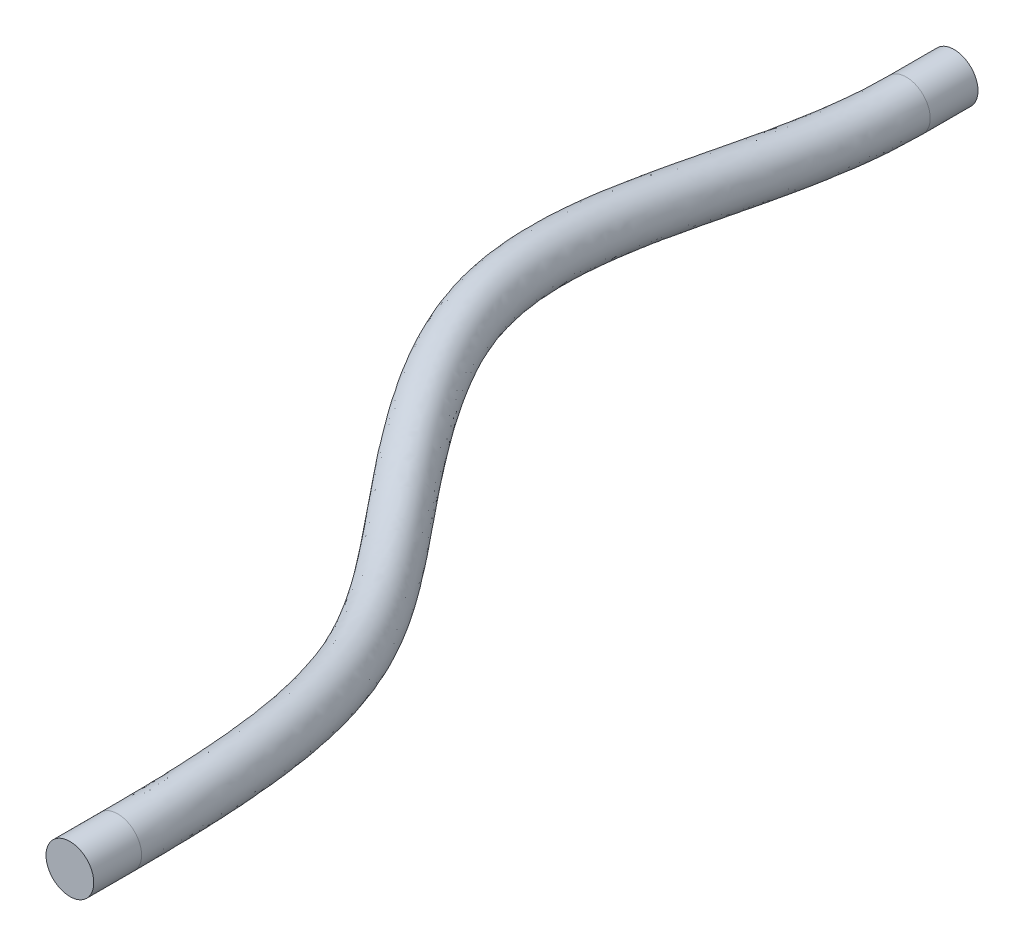
ISO-10303-21;
HEADER;
FILE_DESCRIPTION(('STEP AP214'),'2;1');
FILE_NAME('part.step','',(''),(''),'','','');
FILE_SCHEMA(('AUTOMOTIVE_DESIGN { 1 0 10303 214 1 1 1 1 }'));
ENDSEC;
DATA;
#1=APPLICATION_CONTEXT('core data for automotive mechanical design processes');
#2=APPLICATION_PROTOCOL_DEFINITION('international standard','automotive_design',2000,#1);
#3=PRODUCT_CONTEXT('',#1,'mechanical');
#4=PRODUCT('Part','Part','',(#3));
#5=PRODUCT_RELATED_PRODUCT_CATEGORY('part','',(#4));
#6=PRODUCT_DEFINITION_FORMATION('','',#4);
#7=PRODUCT_DEFINITION_CONTEXT('part definition',#1,'design');
#8=PRODUCT_DEFINITION('design','',#6,#7);
#9=PRODUCT_DEFINITION_SHAPE('','',#8);
#10=(LENGTH_UNIT() NAMED_UNIT(*) SI_UNIT(.MILLI.,.METRE.));
#11=(NAMED_UNIT(*) PLANE_ANGLE_UNIT() SI_UNIT($,.RADIAN.));
#12=(NAMED_UNIT(*) SI_UNIT($,.STERADIAN.) SOLID_ANGLE_UNIT());
#13=UNCERTAINTY_MEASURE_WITH_UNIT(LENGTH_MEASURE(1.E-05),#10,'distance_accuracy_value','');
#14=(GEOMETRIC_REPRESENTATION_CONTEXT(3) GLOBAL_UNCERTAINTY_ASSIGNED_CONTEXT((#13)) GLOBAL_UNIT_ASSIGNED_CONTEXT((#10,
#11,#12)) REPRESENTATION_CONTEXT('',''));
#15=CARTESIAN_POINT('',(0.,0.,0.));
#16=DIRECTION('',(0.,0.,1.));
#17=DIRECTION('',(1.,0.,0.));
#18=AXIS2_PLACEMENT_3D('',#15,#16,#17);
#19=CARTESIAN_POINT('',(4.50000000000121,-1.09999999999973,24.5));
#20=DIRECTION('',(0.,0.,-1.));
#21=DIRECTION('',(-1.,0.,0.));
#22=AXIS2_PLACEMENT_3D('',#19,#20,#21);
#23=PLANE('',#22);
#24=CARTESIAN_POINT('',(4.50000000000121,-1.09999999999973,24.5));
#25=DIRECTION('',(0.,0.,-1.));
#26=DIRECTION('',(-1.,0.,0.));
#27=AXIS2_PLACEMENT_3D('',#24,#25,#26);
#28=CIRCLE('',#27,0.5);
#29=CARTESIAN_POINT('',(4.00000000000121,-1.09999999999973,24.5));
#30=VERTEX_POINT('',#29);
#31=EDGE_CURVE('E56',#30,#30,#28,.T.);
#32=ORIENTED_EDGE('',*,*,#31,.F.);
#33=EDGE_LOOP('',(#32));
#34=FACE_BOUND('',#33,.T.);
#35=ADVANCED_FACE('F42',(#34),#23,.F.);
#36=CARTESIAN_POINT('',(-1.49999999999994,-2.,0.));
#37=DIRECTION('',(0.,0.,-1.));
#38=DIRECTION('',(-0.999303309724129,0.0373215108804992,0.));
#39=AXIS2_PLACEMENT_3D('',#36,#37,#38);
#40=PLANE('',#39);
#41=CARTESIAN_POINT('',(-1.49999999999994,-2.,0.));
#42=DIRECTION('',(0.,0.,-1.));
#43=DIRECTION('',(-0.999303309724129,0.0373215108804992,0.));
#44=AXIS2_PLACEMENT_3D('',#41,#42,#43);
#45=CIRCLE('',#44,0.5);
#46=CARTESIAN_POINT('',(-1.999651654862,-1.98133924455975,0.));
#47=VERTEX_POINT('',#46);
#48=EDGE_CURVE('E11',#47,#47,#45,.T.);
#49=ORIENTED_EDGE('',*,*,#48,.T.);
#50=EDGE_LOOP('',(#49));
#51=FACE_BOUND('',#50,.T.);
#52=ADVANCED_FACE('F65',(#51),#40,.T.);
#53=CARTESIAN_POINT('',(4.50000000000121,-1.09999999999973,24.5));
#54=DIRECTION('',(0.,0.,-1.));
#55=DIRECTION('',(-1.,0.,0.));
#56=AXIS2_PLACEMENT_3D('',#53,#54,#55);
#57=CYLINDRICAL_SURFACE('',#56,0.5);
#58=CARTESIAN_POINT('',(4.50000000000121,-1.09999999999973,23.5));
#59=DIRECTION('',(0.,0.,-1.));
#60=DIRECTION('',(-1.,0.,0.));
#61=AXIS2_PLACEMENT_3D('',#58,#59,#60);
#62=CIRCLE('',#61,0.5);
#63=CARTESIAN_POINT('',(4.00000000000121,-1.09999999999973,23.5));
#64=VERTEX_POINT('',#63);
#65=EDGE_CURVE('E52',#64,#64,#62,.T.);
#66=ORIENTED_EDGE('',*,*,#65,.F.);
#67=EDGE_LOOP('',(#66));
#68=FACE_BOUND('',#67,.T.);
#69=ORIENTED_EDGE('',*,*,#31,.T.);
#70=EDGE_LOOP('',(#69));
#71=FACE_BOUND('',#70,.T.);
#72=ADVANCED_FACE('F62',(#68,#71),#57,.T.);
#73=CARTESIAN_POINT('',(4.00000000000121,-1.09999999999973,23.5));
#74=CARTESIAN_POINT('',(4.00000000000121,-1.09999999999973,23.4361350562141));
#75=CARTESIAN_POINT('',(3.99968115677382,-1.10014525288896,23.3478361623424));
#76=CARTESIAN_POINT('',(3.99841257415394,-1.10071576909623,23.1980930058211));
#77=CARTESIAN_POINT('',(3.99746283468125,-1.1011410325585,23.1240234586619));
#78=CARTESIAN_POINT('',(3.99367755373388,-1.10282105608955,22.9041770062873));
#79=CARTESIAN_POINT('',(3.98990591903971,-1.10447968724955,22.7607623447617));
#80=CARTESIAN_POINT('',(3.97493004734799,-1.11094915492559,22.3396142263468));
#81=CARTESIAN_POINT('',(3.96006447858308,-1.11725195602833,22.0709779494872));
#82=CARTESIAN_POINT('',(3.90150536847141,-1.14113692238511,21.2985923109426));
#83=CARTESIAN_POINT('',(3.84385354375334,-1.16368597032658,20.8284006281778));
#84=CARTESIAN_POINT('',(3.62057951419366,-1.24337779325591,19.5281281171749));
#85=CARTESIAN_POINT('',(3.40531193578686,-1.31237484375074,18.8087987877165));
#86=CARTESIAN_POINT('',(2.59209399573615,-1.50974564376664,16.8828275176393));
#87=CARTESIAN_POINT('',(1.81832565242064,-1.63388228355484,15.8948258328091));
#88=CARTESIAN_POINT('',(-0.151708255406224,-1.53208380546103,13.4328230987474));
#89=CARTESIAN_POINT('',(-1.37349060850916,-1.27422207626163,11.9474032213974));
#90=CARTESIAN_POINT('',(-2.50171725322237,-1.2501277002254,8.72227467496094));
#91=CARTESIAN_POINT('',(-2.49310835766103,-1.43806312487253,7.13512311912592));
#92=CARTESIAN_POINT('',(-2.30510128972106,-1.71185871362405,4.78880988628746));
#93=CARTESIAN_POINT('',(-2.21218814716979,-1.80248367210421,4.0102750882686));
#94=CARTESIAN_POINT('',(-2.09760784001008,-1.90357781053703,2.86214669850516));
#95=CARTESIAN_POINT('',(-2.06350005900672,-1.93148380624608,2.48276596173872));
#96=CARTESIAN_POINT('',(-2.01451935392189,-1.97036527138771,1.7335167214178));
#97=CARTESIAN_POINT('',(-1.999651654862,-1.98133924455975,1.37436173089938));
#98=CARTESIAN_POINT('',(-1.999651654862,-1.98133924455975,1.));
#99=CARTESIAN_POINT('',(4.00000000000129,-0.0999999999997184,23.5000000000001));
#100=CARTESIAN_POINT('',(4.00000000000129,-0.0999999999997184,23.4355025635173));
#101=CARTESIAN_POINT('',(3.9996756550928,-0.100147653919767,23.3453017677704));
#102=CARTESIAN_POINT('',(3.99838483421848,-0.100727866003979,23.1930122550165));
#103=CARTESIAN_POINT('',(3.99741835784697,-0.101160424401475,23.1176657606331));
#104=CARTESIAN_POINT('',(3.99356575809922,-0.102869781979667,22.8939793166009));
#105=CARTESIAN_POINT('',(3.98972713970423,-0.104557914651464,22.7479923611797));
#106=CARTESIAN_POINT('',(3.9744744464216,-0.111146168402972,22.3191104803805));
#107=CARTESIAN_POINT('',(3.95932563736644,-0.117568826233962,22.045294427489));
#108=CARTESIAN_POINT('',(3.8995916227637,-0.141930131604691,21.257503096019));
#109=CARTESIAN_POINT('',(3.84071012310085,-0.164959182960105,20.7771990787842));
#110=CARTESIAN_POINT('',(3.61270317030013,-0.246334787617354,19.4494521328888));
#111=CARTESIAN_POINT('',(3.39245182884082,-0.316770928105496,18.7159585027101));
#112=CARTESIAN_POINT('',(2.57522168882396,-0.515112358844272,16.7805172789355));
#113=CARTESIAN_POINT('',(1.82678259419334,-0.632989840751899,15.8359765291745));
#114=CARTESIAN_POINT('',(-0.0495356519686248,-0.536033994269734,13.4910941980295));
#115=CARTESIAN_POINT('',(-1.28701566535654,-0.276708632113286,12.0075178904033));
#116=CARTESIAN_POINT('',(-2.46403780411843,-0.251572171874534,8.64290385970923));
#117=CARTESIAN_POINT('',(-2.44821736044878,-0.445674098204299,7.02042847470561));
#118=CARTESIAN_POINT('',(-2.26047835658406,-0.719044496183215,4.6777682981165));
#119=CARTESIAN_POINT('',(-2.16858410429409,-0.808452254666247,3.90860900350036));
#120=CARTESIAN_POINT('',(-2.0567079473643,-0.907147707514183,2.78772768557269));
#121=CARTESIAN_POINT('',(-2.02365406398241,-0.934175322360974,2.41967291158866));
#122=CARTESIAN_POINT('',(-1.97645840776356,-0.971621631376582,1.6980885697577));
#123=CARTESIAN_POINT('',(-1.96233014398148,-0.982035934835479,1.3648259440585));
#124=CARTESIAN_POINT('',(-1.96233014398148,-0.982035934835479,1.));
#125=CARTESIAN_POINT('',(5.00000000000128,-0.0999999999997184,23.5000000000001));
#126=CARTESIAN_POINT('',(5.00000000000128,-0.0999999999997184,23.4341131027725));
#127=CARTESIAN_POINT('',(4.99966407687957,-0.100152698215623,23.3396993068625));
#128=CARTESIAN_POINT('',(4.99832464695511,-0.100754092150858,23.1816719954153));
#129=CARTESIAN_POINT('',(4.99732113972581,-0.101202788135579,23.1034112408891));
#130=CARTESIAN_POINT('',(4.99331563139907,-0.102978784680449,22.870843971233));
#131=CARTESIAN_POINT('',(4.98931937998297,-0.104736370235066,22.7187522995265));
#132=CARTESIAN_POINT('',(4.9733953679778,-0.111612777507181,22.2709917311266));
#133=CARTESIAN_POINT('',(4.95753518041336,-0.118337152654968,21.9838345481784));
#134=CARTESIAN_POINT('',(4.89459369715963,-0.143999636666593,21.1537370893193));
#135=CARTESIAN_POINT('',(4.83213452990387,-0.168443542845495,20.642116382014));
#136=CARTESIAN_POINT('',(4.58670535963338,-0.256021989582821,19.2129078199027));
#137=CARTESIAN_POINT('',(4.34457388071365,-0.333585218449242,18.4008598434844));
#138=CARTESIAN_POINT('',(3.43655835021479,-0.553947333029339,16.2504077135315));
#139=CARTESIAN_POINT('',(2.61087454335881,-0.676591382977529,15.2168155897679));
#140=CARTESIAN_POINT('',(0.724476596821684,-0.57911374584145,12.8593363290388));
#141=CARTESIAN_POINT('',(-0.429721252052335,-0.336673482262628,11.4355012324166));
#142=CARTESIAN_POINT('',(-1.44686481842573,-0.314951246064697,8.52791321513729));
#143=CARTESIAN_POINT('',(-1.44826209202822,-0.487008050045194,7.05305668857034));
#144=CARTESIAN_POINT('',(-1.26668916963627,-0.751424334771399,4.78733794501209));
#145=CARTESIAN_POINT('',(-1.17569717180722,-0.840444287511684,4.02407678812386));
#146=CARTESIAN_POINT('',(-1.06182661760545,-0.940914983511058,2.88320595843174));
#147=CARTESIAN_POINT('',(-1.02764178531297,-0.96889684553144,2.5035823741962));
#148=CARTESIAN_POINT('',(-0.978240371338396,-1.00811877212791,1.74824383877972));
#149=CARTESIAN_POINT('',(-0.963026834257353,-1.01935744571597,1.37879412653743));
#150=CARTESIAN_POINT('',(-0.963026834257353,-1.01935744571597,1.));
#151=CARTESIAN_POINT('',(5.00000000000121,-1.09999999999973,23.5));
#152=CARTESIAN_POINT('',(5.00000000000121,-1.09999999999973,23.4347455954692));
#153=CARTESIAN_POINT('',(4.99966957856059,-1.10015029718478,23.3422337014344));
#154=CARTESIAN_POINT('',(4.99835238689057,-1.10074199524313,23.1867527462199));
#155=CARTESIAN_POINT('',(4.99736561656013,-1.1011833962926,23.1097689389179));
#156=CARTESIAN_POINT('',(4.99342742703367,-1.10293005879034,22.8810416609193));
#157=CARTESIAN_POINT('',(4.98949815931844,-1.10465814283314,22.7315222831086));
#158=CARTESIAN_POINT('',(4.97385096890418,-1.11141576402983,22.2914954770927));
#159=CARTESIAN_POINT('',(4.95827402163,-1.11802028244934,22.0095180701768));
#160=CARTESIAN_POINT('',(4.89650744286733,-1.14320642744702,21.1948263042425));
#161=CARTESIAN_POINT('',(4.83527795055655,-1.16717033021192,20.6933179314076));
#162=CARTESIAN_POINT('',(4.59458170352652,-1.25306499522163,19.2915838041889));
#163=CARTESIAN_POINT('',(4.3574339876597,-1.32918913409449,18.4937001284914));
#164=CARTESIAN_POINT('',(3.45343065712697,-1.54858061795179,16.352717952234));
#165=CARTESIAN_POINT('',(2.60241760158612,-1.67748382578063,15.2756648934012));
#166=CARTESIAN_POINT('',(0.622303993384088,-1.57516355703258,12.8010652297582));
#167=CARTESIAN_POINT('',(-0.516196195205001,-1.33418692641116,11.3753865634092));
#168=CARTESIAN_POINT('',(-1.48454426752966,-1.31350677441538,8.6072840303903));
#169=CARTESIAN_POINT('',(-1.49315308924048,-1.47939707671343,7.16775133299066));
#170=CARTESIAN_POINT('',(-1.31131210277328,-1.74423855221223,4.89837953318305));
#171=CARTESIAN_POINT('',(-1.21930121468301,-1.83447570494961,4.12574287289209));
#172=CARTESIAN_POINT('',(-1.10272651025119,-1.93734508653391,2.95762497136421));
#173=CARTESIAN_POINT('',(-1.06748778033727,-1.96620532941658,2.56667542434591));
#174=CARTESIAN_POINT('',(-1.01630131749674,-2.00686241213902,1.78367199044015));
#175=CARTESIAN_POINT('',(-1.00034834513787,-2.01866075544024,1.38832991337831));
#176=CARTESIAN_POINT('',(-1.00034834513787,-2.01866075544024,1.));
#177=CARTESIAN_POINT('',(5.00000000000128,-2.09999999999971,23.5000000000001));
#178=CARTESIAN_POINT('',(5.00000000000128,-2.09999999999971,23.4353780881661));
#179=CARTESIAN_POINT('',(4.99967508024174,-2.10014789615395,23.3447680960064));
#180=CARTESIAN_POINT('',(4.99838012682618,-2.10072989833537,23.1918334970246));
#181=CARTESIAN_POINT('',(4.99741009339458,-2.10116400444962,23.1161266369468));
#182=CARTESIAN_POINT('',(4.9935392226684,-2.10288133290019,22.8912393506058));
#183=CARTESIAN_POINT('',(4.98967693865406,-2.10457991543121,22.7442922666909));
#184=CARTESIAN_POINT('',(4.97430656983072,-2.11121875055246,22.3119992230588));
#185=CARTESIAN_POINT('',(4.95901286284678,-2.11770341224387,22.0352015921752));
#186=CARTESIAN_POINT('',(4.89842118857519,-2.14241321822761,21.2359155191656));
#187=CARTESIAN_POINT('',(4.83842137120939,-2.16589711757852,20.7445194808012));
#188=CARTESIAN_POINT('',(4.60245804741979,-2.25010800086046,19.3702597884752));
#189=CARTESIAN_POINT('',(4.37029409460587,-2.32479304973963,18.5865404134985));
#190=CARTESIAN_POINT('',(3.47030296403931,-2.54321390287399,16.4550281909366));
#191=CARTESIAN_POINT('',(2.59396065981357,-2.67837626858346,15.3345141970345));
#192=CARTESIAN_POINT('',(0.520131389946624,-2.57121336822343,12.7427941304776));
#193=CARTESIAN_POINT('',(-0.602671138357529,-2.3317003705594,11.3152718944019));
#194=CARTESIAN_POINT('',(-1.52222371663355,-2.31206230276602,8.68665484564335));
#195=CARTESIAN_POINT('',(-1.53804408645269,-2.47178610338185,7.28244597741102));
#196=CARTESIAN_POINT('',(-1.35593503591024,-2.73705276965307,5.00942112135406));
#197=CARTESIAN_POINT('',(-1.26290525755876,-2.82850712238755,4.22740895766037));
#198=CARTESIAN_POINT('',(-1.14362640289688,-2.93377518955678,3.03204398429674));
#199=CARTESIAN_POINT('',(-1.10733377536154,-2.96351381330154,2.62976847449569));
#200=CARTESIAN_POINT('',(-1.05436226365504,-3.00560605214981,1.81910014210063));
#201=CARTESIAN_POINT('',(-1.03766985601834,-3.01796406516423,1.39786570021924));
#202=CARTESIAN_POINT('',(-1.03766985601834,-3.01796406516423,1.));
#203=CARTESIAN_POINT('',(4.00000000000129,-2.09999999999971,23.5000000000001));
#204=CARTESIAN_POINT('',(4.00000000000129,-2.09999999999971,23.4367675489109));
#205=CARTESIAN_POINT('',(3.99968665845497,-2.10014285185811,23.3503705569144));
#206=CARTESIAN_POINT('',(3.99844031408954,-2.10070367218849,23.2031737566257));
#207=CARTESIAN_POINT('',(3.99750731151567,-2.10112164071551,23.1303811566908));
#208=CARTESIAN_POINT('',(3.99378934936869,-2.10277233019941,22.9143746959737));
#209=CARTESIAN_POINT('',(3.99008469837533,-2.10440145984765,22.7735323283438));
#210=CARTESIAN_POINT('',(3.97538564827452,-2.11075214144819,22.3601179723131));
#211=CARTESIAN_POINT('',(3.96080331979986,-2.11693508582286,22.0966614714854));
#212=CARTESIAN_POINT('',(3.90341911417926,-2.14034371316571,21.3396815258662));
#213=CARTESIAN_POINT('',(3.84699696440597,-2.16241275769324,20.8796021775714));
#214=CARTESIAN_POINT('',(3.62845585808734,-2.24042079889464,19.6068041014612));
#215=CARTESIAN_POINT('',(3.41817204273304,-2.30797875939588,18.9016390727229));
#216=CARTESIAN_POINT('',(2.60896630264849,-2.5043789286889,16.9851377563431));
#217=CARTESIAN_POINT('',(1.80986871064809,-2.63477472635749,15.9536751364437));
#218=CARTESIAN_POINT('',(-0.253880858843685,-2.52813361665205,13.3745519994655));
#219=CARTESIAN_POINT('',(-1.45996555166172,-2.2717355204097,11.8872885523915));
#220=CARTESIAN_POINT('',(-2.53939670232625,-2.24868322857617,8.8016454902127));
#221=CARTESIAN_POINT('',(-2.53799935487324,-2.43045215154093,7.24981776354628));
#222=CARTESIAN_POINT('',(-2.34972422285802,-2.70467293106488,4.89985147445846));
#223=CARTESIAN_POINT('',(-2.25579219004545,-2.79651508954219,4.11194117303689));
#224=CARTESIAN_POINT('',(-2.13850773265582,-2.90000791355986,2.93656571143768));
#225=CARTESIAN_POINT('',(-2.10334605403098,-2.92879229013104,2.54585901188883));
#226=CARTESIAN_POINT('',(-2.05258030008019,-2.96910891139852,1.76894487307796));
#227=CARTESIAN_POINT('',(-2.03697316574247,-2.98064255428374,1.38389751774031));
#228=CARTESIAN_POINT('',(-2.03697316574247,-2.98064255428374,1.));
#229=CARTESIAN_POINT('',(4.00000000000121,-1.09999999999973,23.5));
#230=CARTESIAN_POINT('',(4.00000000000121,-1.09999999999973,23.4361350562141));
#231=CARTESIAN_POINT('',(3.99968115677382,-1.10014525288896,23.3478361623424));
#232=CARTESIAN_POINT('',(3.99841257415394,-1.10071576909623,23.1980930058211));
#233=CARTESIAN_POINT('',(3.99746283468125,-1.1011410325585,23.1240234586619));
#234=CARTESIAN_POINT('',(3.99367755373388,-1.10282105608955,22.9041770062873));
#235=CARTESIAN_POINT('',(3.98990591903971,-1.10447968724955,22.7607623447617));
#236=CARTESIAN_POINT('',(3.97493004734799,-1.11094915492559,22.3396142263468));
#237=CARTESIAN_POINT('',(3.96006447858308,-1.11725195602833,22.0709779494872));
#238=CARTESIAN_POINT('',(3.90150536847141,-1.14113692238511,21.2985923109426));
#239=CARTESIAN_POINT('',(3.84385354375334,-1.16368597032658,20.8284006281778));
#240=CARTESIAN_POINT('',(3.62057951419366,-1.24337779325591,19.5281281171749));
#241=CARTESIAN_POINT('',(3.40531193578686,-1.31237484375074,18.8087987877165));
#242=CARTESIAN_POINT('',(2.59209399573615,-1.50974564376664,16.8828275176393));
#243=CARTESIAN_POINT('',(1.81832565242064,-1.63388228355484,15.8948258328091));
#244=CARTESIAN_POINT('',(-0.151708255406224,-1.53208380546103,13.4328230987474));
#245=CARTESIAN_POINT('',(-1.37349060850916,-1.27422207626163,11.9474032213974));
#246=CARTESIAN_POINT('',(-2.50171725322237,-1.2501277002254,8.72227467496094));
#247=CARTESIAN_POINT('',(-2.49310835766103,-1.43806312487253,7.13512311912592));
#248=CARTESIAN_POINT('',(-2.30510128972106,-1.71185871362405,4.78880988628746));
#249=CARTESIAN_POINT('',(-2.21218814716979,-1.80248367210421,4.0102750882686));
#250=CARTESIAN_POINT('',(-2.09760784001008,-1.90357781053703,2.86214669850516));
#251=CARTESIAN_POINT('',(-2.06350005900672,-1.93148380624608,2.48276596173872));
#252=CARTESIAN_POINT('',(-2.01451935392189,-1.97036527138771,1.7335167214178));
#253=CARTESIAN_POINT('',(-1.999651654862,-1.98133924455975,1.37436173089938));
#254=CARTESIAN_POINT('',(-1.999651654862,-1.98133924455975,1.));
#255=(BOUNDED_SURFACE() B_SPLINE_SURFACE(3,3,((#73,#74,#75,#76,#77,#78,#79,#80,#81,#82,#83,#84,
#85,#86,#87,#88,#89,#90,#91,#92,#93,#94,#95,#96,#97,#98),(#99,#100,#101,#102,#103,#104,#105,
#106,#107,#108,#109,#110,#111,#112,#113,#114,#115,#116,#117,#118,#119,#120,#121,#122,#123,#124),
(#125,#126,#127,#128,#129,#130,#131,#132,#133,#134,#135,#136,#137,#138,#139,#140,#141,#142,#143,
#144,#145,#146,#147,#148,#149,#150),(#151,#152,#153,#154,#155,#156,#157,#158,#159,#160,#161,
#162,#163,#164,#165,#166,#167,#168,#169,#170,#171,#172,#173,#174,#175,#176),(#177,#178,#179,
#180,#181,#182,#183,#184,#185,#186,#187,#188,#189,#190,#191,#192,#193,#194,#195,#196,#197,#198,
#199,#200,#201,#202),(#203,#204,#205,#206,#207,#208,#209,#210,#211,#212,#213,#214,#215,#216,
#217,#218,#219,#220,#221,#222,#223,#224,#225,#226,#227,#228),(#229,#230,#231,#232,#233,#234,
#235,#236,#237,#238,#239,#240,#241,#242,#243,#244,#245,#246,#247,#248,#249,#250,#251,#252,#253,
#254)),.UNSPECIFIED.,.T.,.F.,.F.) B_SPLINE_SURFACE_WITH_KNOTS((4,3,4),(4,2,2,2,2,2,2,2,2,2,2,2,
4),(0.,0.5,1.),(0.0380498493975753,0.0438988332492791,0.0497478171009828,0.0614457848043902,
0.0848417202112051,0.131633591024835,0.225217332652095,0.412384815906614,0.610316133783219,
0.786133142192822,0.874041646397623,0.917995898500024,0.961950150602425),
.UNSPECIFIED.) GEOMETRIC_REPRESENTATION_ITEM() RATIONAL_B_SPLINE_SURFACE(((1.,1.,1.,1.,1.,1.,1.,
1.,1.,1.,1.,1.,1.,1.,1.,1.,1.,1.,1.,1.,1.,1.,1.,1.,1.,1.),(0.333333333333333,0.333333333333333,
0.333333333333333,0.333333333333333,0.333333333333333,0.333333333333333,0.333333333333333,
0.333333333333333,0.333333333333333,0.333333333333333,0.333333333333333,0.333333333333333,
0.333333333333333,0.333333333333333,0.333333333333333,0.333333333333333,0.333333333333333,
0.333333333333333,0.333333333333333,0.333333333333333,0.333333333333333,0.333333333333333,
0.333333333333333,0.333333333333333,0.333333333333333,0.333333333333333),(0.333333333333333,
0.333333333333333,0.333333333333333,0.333333333333333,0.333333333333333,0.333333333333333,
0.333333333333333,0.333333333333333,0.333333333333333,0.333333333333333,0.333333333333333,
0.333333333333333,0.333333333333333,0.333333333333333,0.333333333333333,0.333333333333333,
0.333333333333333,0.333333333333333,0.333333333333333,0.333333333333333,0.333333333333333,
0.333333333333333,0.333333333333333,0.333333333333333,0.333333333333333,0.333333333333333),(1.,
1.,1.,1.,1.,1.,1.,1.,1.,1.,1.,1.,1.,1.,1.,1.,1.,1.,1.,1.,1.,1.,1.,1.,1.,1.),(0.333333333333333,
0.333333333333333,0.333333333333333,0.333333333333333,0.333333333333333,0.333333333333333,
0.333333333333333,0.333333333333333,0.333333333333333,0.333333333333333,0.333333333333333,
0.333333333333333,0.333333333333333,0.333333333333333,0.333333333333333,0.333333333333333,
0.333333333333333,0.333333333333333,0.333333333333333,0.333333333333333,0.333333333333333,
0.333333333333333,0.333333333333333,0.333333333333333,0.333333333333333,0.333333333333333),
(0.333333333333333,0.333333333333333,0.333333333333333,0.333333333333333,0.333333333333333,
0.333333333333333,0.333333333333333,0.333333333333333,0.333333333333333,0.333333333333333,
0.333333333333333,0.333333333333333,0.333333333333333,0.333333333333333,0.333333333333333,
0.333333333333333,0.333333333333333,0.333333333333333,0.333333333333333,0.333333333333333,
0.333333333333333,0.333333333333333,0.333333333333333,0.333333333333333,0.333333333333333,
0.333333333333333),(1.,1.,1.,1.,1.,1.,1.,1.,1.,1.,1.,1.,1.,1.,1.,1.,1.,1.,1.,1.,1.,1.,1.,1.,1.,1.))) REPRESENTATION_ITEM('') SURFACE());
#256=CARTESIAN_POINT('',(-1.49999999999994,-2.,0.999999999999997));
#257=DIRECTION('',(0.,0.,-1.));
#258=DIRECTION('',(-0.999303309724129,0.0373215108804992,0.));
#259=AXIS2_PLACEMENT_3D('',#256,#257,#258);
#260=CIRCLE('',#259,0.5);
#261=CARTESIAN_POINT('',(-1.999651654862,-1.98133924455975,0.999999999999997));
#262=VERTEX_POINT('',#261);
#263=EDGE_CURVE('E48',#262,#262,#260,.T.);
#264=ORIENTED_EDGE('',*,*,#263,.F.);
#265=EDGE_LOOP('',(#264));
#266=FACE_BOUND('',#265,.T.);
#267=ORIENTED_EDGE('',*,*,#65,.T.);
#268=EDGE_LOOP('',(#267));
#269=FACE_BOUND('',#268,.T.);
#270=ADVANCED_FACE('F71',(#266,#269),#255,.T.);
#271=CARTESIAN_POINT('',(-1.49999999999994,-2.,1.));
#272=DIRECTION('',(0.,0.,-1.));
#273=DIRECTION('',(-1.,0.,0.));
#274=AXIS2_PLACEMENT_3D('',#271,#272,#273);
#275=CYLINDRICAL_SURFACE('',#274,0.5);
#276=ORIENTED_EDGE('',*,*,#48,.F.);
#277=EDGE_LOOP('',(#276));
#278=FACE_BOUND('',#277,.T.);
#279=ORIENTED_EDGE('',*,*,#263,.T.);
#280=EDGE_LOOP('',(#279));
#281=FACE_BOUND('',#280,.T.);
#282=ADVANCED_FACE('F69',(#278,#281),#275,.T.);
#283=CLOSED_SHELL('',(#35,#52,#72,#270,#282));
#284=MANIFOLD_SOLID_BREP('B2',#283);
#285=ADVANCED_BREP_SHAPE_REPRESENTATION('',(#18,#284),#14);
#286=SHAPE_DEFINITION_REPRESENTATION(#9,#285);
ENDSEC;
END-ISO-10303-21;
